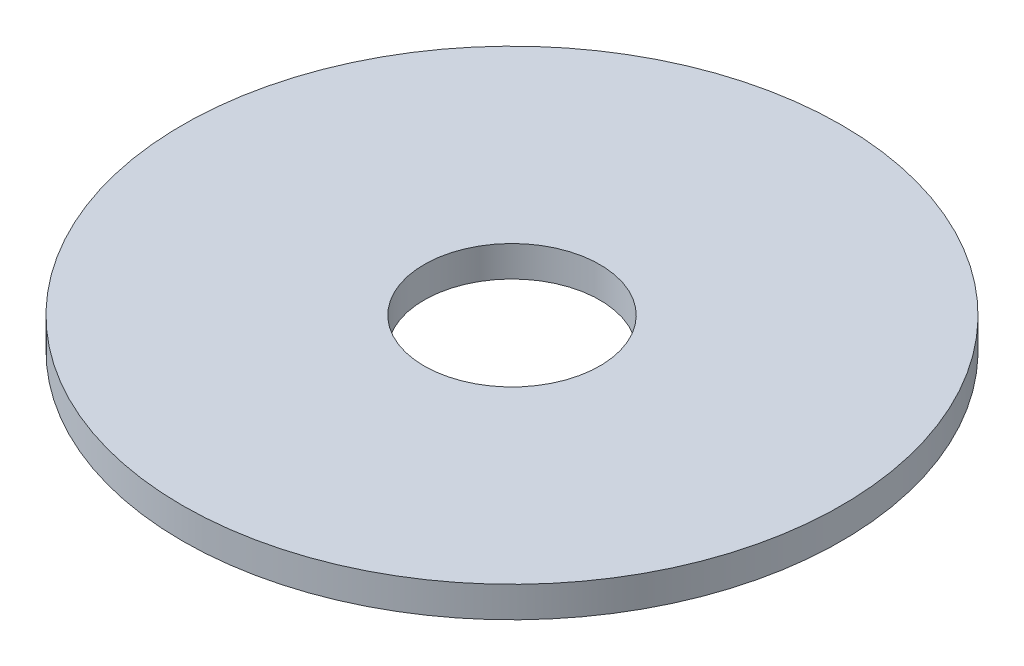
ISO-10303-21;
HEADER;
FILE_DESCRIPTION(('STEP AP214'),'2;1');
FILE_NAME('part.step','',(''),(''),'','','');
FILE_SCHEMA(('AUTOMOTIVE_DESIGN { 1 0 10303 214 1 1 1 1 }'));
ENDSEC;
DATA;
#1=APPLICATION_CONTEXT('core data for automotive mechanical design processes');
#2=APPLICATION_PROTOCOL_DEFINITION('international standard','automotive_design',2000,#1);
#3=PRODUCT_CONTEXT('',#1,'mechanical');
#4=PRODUCT('Part','Part','',(#3));
#5=PRODUCT_RELATED_PRODUCT_CATEGORY('part','',(#4));
#6=PRODUCT_DEFINITION_FORMATION('','',#4);
#7=PRODUCT_DEFINITION_CONTEXT('part definition',#1,'design');
#8=PRODUCT_DEFINITION('design','',#6,#7);
#9=PRODUCT_DEFINITION_SHAPE('','',#8);
#10=(LENGTH_UNIT() NAMED_UNIT(*) SI_UNIT(.MILLI.,.METRE.));
#11=(NAMED_UNIT(*) PLANE_ANGLE_UNIT() SI_UNIT($,.RADIAN.));
#12=(NAMED_UNIT(*) SI_UNIT($,.STERADIAN.) SOLID_ANGLE_UNIT());
#13=UNCERTAINTY_MEASURE_WITH_UNIT(LENGTH_MEASURE(1.E-05),#10,'distance_accuracy_value','');
#14=(GEOMETRIC_REPRESENTATION_CONTEXT(3) GLOBAL_UNCERTAINTY_ASSIGNED_CONTEXT((#13)) GLOBAL_UNIT_ASSIGNED_CONTEXT((#10,
#11,#12)) REPRESENTATION_CONTEXT('',''));
#15=CARTESIAN_POINT('',(0.,0.,0.));
#16=DIRECTION('',(0.,0.,1.));
#17=DIRECTION('',(1.,0.,0.));
#18=AXIS2_PLACEMENT_3D('',#15,#16,#17);
#19=CARTESIAN_POINT('',(0.,1.4,0.));
#20=DIRECTION('',(0.,1.,0.));
#21=DIRECTION('',(0.,0.,1.));
#22=AXIS2_PLACEMENT_3D('',#19,#20,#21);
#23=PLANE('',#22);
#24=CARTESIAN_POINT('',(0.,1.4,0.));
#25=DIRECTION('',(0.,1.,0.));
#26=DIRECTION('',(0.,0.,1.));
#27=AXIS2_PLACEMENT_3D('',#24,#25,#26);
#28=CIRCLE('',#27,15.);
#29=CARTESIAN_POINT('',(0.,1.4,15.));
#30=VERTEX_POINT('',#29);
#31=EDGE_CURVE('E10',#30,#30,#28,.T.);
#32=ORIENTED_EDGE('',*,*,#31,.T.);
#33=EDGE_LOOP('',(#32));
#34=FACE_BOUND('',#33,.T.);
#35=CARTESIAN_POINT('',(0.,1.4,0.));
#36=DIRECTION('',(0.,1.,0.));
#37=DIRECTION('',(0.,0.,1.));
#38=AXIS2_PLACEMENT_3D('',#35,#36,#37);
#39=CIRCLE('',#38,4.);
#40=CARTESIAN_POINT('',(0.,1.4,4.));
#41=VERTEX_POINT('',#40);
#42=EDGE_CURVE('E42',#41,#41,#39,.T.);
#43=ORIENTED_EDGE('',*,*,#42,.F.);
#44=EDGE_LOOP('',(#43));
#45=FACE_BOUND('',#44,.T.);
#46=ADVANCED_FACE('F31',(#34,#45),#23,.T.);
#47=CARTESIAN_POINT('',(0.,0.,0.));
#48=DIRECTION('',(0.,1.,0.));
#49=DIRECTION('',(0.,0.,1.));
#50=AXIS2_PLACEMENT_3D('',#47,#48,#49);
#51=PLANE('',#50);
#52=CARTESIAN_POINT('',(0.,0.,0.));
#53=DIRECTION('',(0.,1.,0.));
#54=DIRECTION('',(0.,0.,1.));
#55=AXIS2_PLACEMENT_3D('',#52,#53,#54);
#56=CIRCLE('',#55,15.);
#57=CARTESIAN_POINT('',(0.,0.,15.));
#58=VERTEX_POINT('',#57);
#59=EDGE_CURVE('E35',#58,#58,#56,.T.);
#60=ORIENTED_EDGE('',*,*,#59,.F.);
#61=EDGE_LOOP('',(#60));
#62=FACE_BOUND('',#61,.T.);
#63=CARTESIAN_POINT('',(0.,0.,0.));
#64=DIRECTION('',(0.,1.,0.));
#65=DIRECTION('',(0.,0.,1.));
#66=AXIS2_PLACEMENT_3D('',#63,#64,#65);
#67=CIRCLE('',#66,4.);
#68=CARTESIAN_POINT('',(0.,0.,4.));
#69=VERTEX_POINT('',#68);
#70=EDGE_CURVE('E44',#69,#69,#67,.T.);
#71=ORIENTED_EDGE('',*,*,#70,.T.);
#72=EDGE_LOOP('',(#71));
#73=FACE_BOUND('',#72,.T.);
#74=ADVANCED_FACE('F54',(#62,#73),#51,.F.);
#75=CARTESIAN_POINT('',(0.,1.4,0.));
#76=DIRECTION('',(0.,-1.,0.));
#77=DIRECTION('',(0.,0.,-1.));
#78=AXIS2_PLACEMENT_3D('',#75,#76,#77);
#79=CYLINDRICAL_SURFACE('',#78,15.);
#80=ORIENTED_EDGE('',*,*,#31,.F.);
#81=EDGE_LOOP('',(#80));
#82=FACE_BOUND('',#81,.T.);
#83=ORIENTED_EDGE('',*,*,#59,.T.);
#84=EDGE_LOOP('',(#83));
#85=FACE_BOUND('',#84,.T.);
#86=ADVANCED_FACE('F33',(#82,#85),#79,.T.);
#87=CARTESIAN_POINT('',(0.,1.4,0.));
#88=DIRECTION('',(0.,-1.,0.));
#89=DIRECTION('',(0.,0.,-1.));
#90=AXIS2_PLACEMENT_3D('',#87,#88,#89);
#91=CYLINDRICAL_SURFACE('',#90,4.);
#92=ORIENTED_EDGE('',*,*,#42,.T.);
#93=EDGE_LOOP('',(#92));
#94=FACE_BOUND('',#93,.T.);
#95=ORIENTED_EDGE('',*,*,#70,.F.);
#96=EDGE_LOOP('',(#95));
#97=FACE_BOUND('',#96,.T.);
#98=ADVANCED_FACE('F50',(#94,#97),#91,.F.);
#99=CLOSED_SHELL('',(#46,#74,#86,#98));
#100=MANIFOLD_SOLID_BREP('B2',#99);
#101=ADVANCED_BREP_SHAPE_REPRESENTATION('',(#18,#100),#14);
#102=SHAPE_DEFINITION_REPRESENTATION(#9,#101);
ENDSEC;
END-ISO-10303-21;
